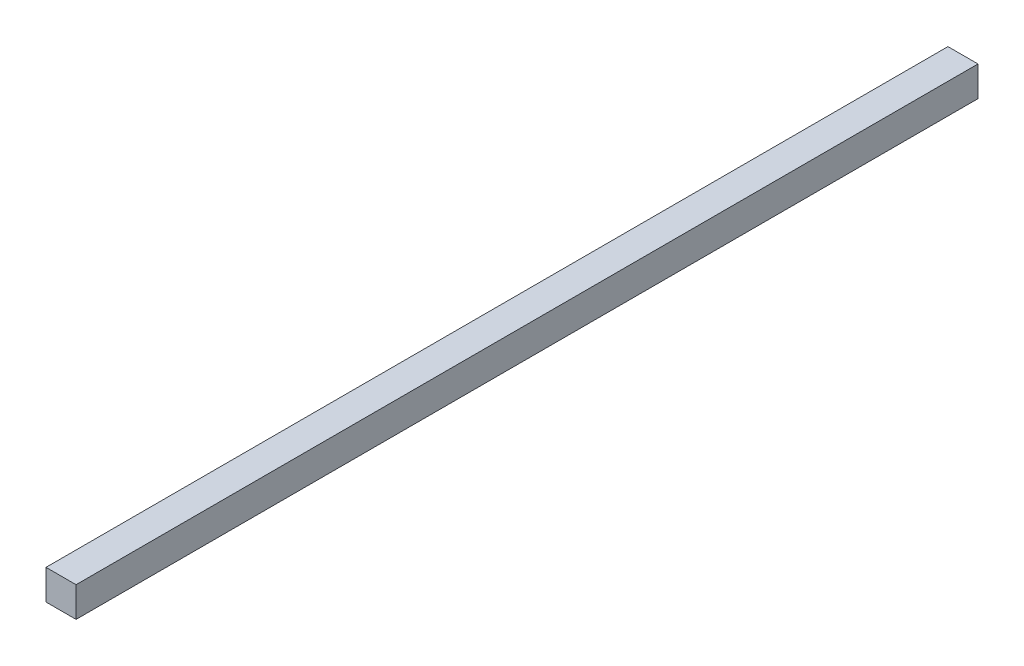
ISO-10303-21;
HEADER;
FILE_DESCRIPTION(('STEP AP214'),'2;1');
FILE_NAME('part.step','',(''),(''),'','','');
FILE_SCHEMA(('AUTOMOTIVE_DESIGN { 1 0 10303 214 1 1 1 1 }'));
ENDSEC;
DATA;
#1=APPLICATION_CONTEXT('core data for automotive mechanical design processes');
#2=APPLICATION_PROTOCOL_DEFINITION('international standard','automotive_design',2000,#1);
#3=PRODUCT_CONTEXT('',#1,'mechanical');
#4=PRODUCT('Part','Part','',(#3));
#5=PRODUCT_RELATED_PRODUCT_CATEGORY('part','',(#4));
#6=PRODUCT_DEFINITION_FORMATION('','',#4);
#7=PRODUCT_DEFINITION_CONTEXT('part definition',#1,'design');
#8=PRODUCT_DEFINITION('design','',#6,#7);
#9=PRODUCT_DEFINITION_SHAPE('','',#8);
#10=(LENGTH_UNIT() NAMED_UNIT(*) SI_UNIT(.MILLI.,.METRE.));
#11=(NAMED_UNIT(*) PLANE_ANGLE_UNIT() SI_UNIT($,.RADIAN.));
#12=(NAMED_UNIT(*) SI_UNIT($,.STERADIAN.) SOLID_ANGLE_UNIT());
#13=UNCERTAINTY_MEASURE_WITH_UNIT(LENGTH_MEASURE(1.E-05),#10,'distance_accuracy_value','');
#14=(GEOMETRIC_REPRESENTATION_CONTEXT(3) GLOBAL_UNCERTAINTY_ASSIGNED_CONTEXT((#13)) GLOBAL_UNIT_ASSIGNED_CONTEXT((#10,
#11,#12)) REPRESENTATION_CONTEXT('',''));
#15=CARTESIAN_POINT('',(0.,0.,0.));
#16=DIRECTION('',(0.,0.,1.));
#17=DIRECTION('',(1.,0.,0.));
#18=AXIS2_PLACEMENT_3D('',#15,#16,#17);
#19=CARTESIAN_POINT('',(-17.9387232059646,5.,300.));
#20=DIRECTION('',(1.,0.,0.));
#21=DIRECTION('',(0.,0.,-1.));
#22=AXIS2_PLACEMENT_3D('',#19,#20,#21);
#23=PLANE('',#22);
#24=DIRECTION('',(0.,-1.,0.));
#25=VECTOR('',#24,1.);
#26=CARTESIAN_POINT('',(-17.9387232059646,5.,0.));
#27=LINE('',#26,#25);
#28=CARTESIAN_POINT('',(-17.9387232059646,5.,0.));
#29=VERTEX_POINT('',#28);
#30=CARTESIAN_POINT('',(-17.9387232059646,-5.,0.));
#31=VERTEX_POINT('',#30);
#32=EDGE_CURVE('E107',#29,#31,#27,.T.);
#33=ORIENTED_EDGE('',*,*,#32,.T.);
#34=DIRECTION('',(0.,0.,-1.));
#35=VECTOR('',#34,1.);
#36=CARTESIAN_POINT('',(-17.9387232059646,-5.,300.));
#37=LINE('',#36,#35);
#38=CARTESIAN_POINT('',(-17.9387232059646,-5.,300.));
#39=VERTEX_POINT('',#38);
#40=EDGE_CURVE('E11',#39,#31,#37,.T.);
#41=ORIENTED_EDGE('',*,*,#40,.F.);
#42=DIRECTION('',(0.,-1.,0.));
#43=VECTOR('',#42,1.);
#44=CARTESIAN_POINT('',(-17.9387232059646,5.,300.));
#45=LINE('',#44,#43);
#46=CARTESIAN_POINT('',(-17.9387232059646,5.,300.));
#47=VERTEX_POINT('',#46);
#48=EDGE_CURVE('E91',#47,#39,#45,.T.);
#49=ORIENTED_EDGE('',*,*,#48,.F.);
#50=DIRECTION('',(0.,0.,-1.));
#51=VECTOR('',#50,1.);
#52=CARTESIAN_POINT('',(-17.9387232059646,5.,300.));
#53=LINE('',#52,#51);
#54=EDGE_CURVE('E103',#47,#29,#53,.T.);
#55=ORIENTED_EDGE('',*,*,#54,.T.);
#56=EDGE_LOOP('',(#33,#41,#49,#55));
#57=FACE_BOUND('',#56,.T.);
#58=ADVANCED_FACE('F39',(#57),#23,.F.);
#59=CARTESIAN_POINT('',(-17.9387232059646,-5.,300.));
#60=DIRECTION('',(0.,1.,0.));
#61=DIRECTION('',(0.,0.,1.));
#62=AXIS2_PLACEMENT_3D('',#59,#60,#61);
#63=PLANE('',#62);
#64=DIRECTION('',(1.,0.,0.));
#65=VECTOR('',#64,1.);
#66=CARTESIAN_POINT('',(-17.9387232059646,-5.,0.));
#67=LINE('',#66,#65);
#68=CARTESIAN_POINT('',(-7.93872320596458,-5.,0.));
#69=VERTEX_POINT('',#68);
#70=EDGE_CURVE('E96',#31,#69,#67,.T.);
#71=ORIENTED_EDGE('',*,*,#70,.T.);
#72=DIRECTION('',(0.,0.,-1.));
#73=VECTOR('',#72,1.);
#74=CARTESIAN_POINT('',(-7.93872320596458,-5.,300.));
#75=LINE('',#74,#73);
#76=CARTESIAN_POINT('',(-7.93872320596458,-5.,300.));
#77=VERTEX_POINT('',#76);
#78=EDGE_CURVE('E48',#77,#69,#75,.T.);
#79=ORIENTED_EDGE('',*,*,#78,.F.);
#80=DIRECTION('',(1.,0.,0.));
#81=VECTOR('',#80,1.);
#82=CARTESIAN_POINT('',(-17.9387232059646,-5.,300.));
#83=LINE('',#82,#81);
#84=EDGE_CURVE('E86',#39,#77,#83,.T.);
#85=ORIENTED_EDGE('',*,*,#84,.F.);
#86=ORIENTED_EDGE('',*,*,#40,.T.);
#87=EDGE_LOOP('',(#71,#79,#85,#86));
#88=FACE_BOUND('',#87,.T.);
#89=ADVANCED_FACE('F95',(#88),#63,.F.);
#90=CARTESIAN_POINT('',(-7.93872320596458,5.,300.));
#91=DIRECTION('',(-1.,0.,0.));
#92=DIRECTION('',(0.,-1.,0.));
#93=AXIS2_PLACEMENT_3D('',#90,#91,#92);
#94=PLANE('',#93);
#95=DIRECTION('',(0.,1.,0.));
#96=VECTOR('',#95,1.);
#97=CARTESIAN_POINT('',(-7.93872320596458,5.,0.));
#98=LINE('',#97,#96);
#99=CARTESIAN_POINT('',(-7.93872320596458,5.,0.));
#100=VERTEX_POINT('',#99);
#101=EDGE_CURVE('E73',#69,#100,#98,.T.);
#102=ORIENTED_EDGE('',*,*,#101,.T.);
#103=DIRECTION('',(0.,0.,-1.));
#104=VECTOR('',#103,1.);
#105=CARTESIAN_POINT('',(-7.93872320596458,5.,300.));
#106=LINE('',#105,#104);
#107=CARTESIAN_POINT('',(-7.93872320596458,5.,300.));
#108=VERTEX_POINT('',#107);
#109=EDGE_CURVE('E98',#108,#100,#106,.T.);
#110=ORIENTED_EDGE('',*,*,#109,.F.);
#111=DIRECTION('',(0.,1.,0.));
#112=VECTOR('',#111,1.);
#113=CARTESIAN_POINT('',(-7.93872320596458,5.,300.));
#114=LINE('',#113,#112);
#115=EDGE_CURVE('E89',#77,#108,#114,.T.);
#116=ORIENTED_EDGE('',*,*,#115,.F.);
#117=ORIENTED_EDGE('',*,*,#78,.T.);
#118=EDGE_LOOP('',(#102,#110,#116,#117));
#119=FACE_BOUND('',#118,.T.);
#120=ADVANCED_FACE('F99',(#119),#94,.F.);
#121=CARTESIAN_POINT('',(-17.9387232059646,5.,300.));
#122=DIRECTION('',(0.,-1.,0.));
#123=DIRECTION('',(0.,0.,-1.));
#124=AXIS2_PLACEMENT_3D('',#121,#122,#123);
#125=PLANE('',#124);
#126=DIRECTION('',(-1.,0.,0.));
#127=VECTOR('',#126,1.);
#128=CARTESIAN_POINT('',(-17.9387232059646,5.,0.));
#129=LINE('',#128,#127);
#130=EDGE_CURVE('E79',#100,#29,#129,.T.);
#131=ORIENTED_EDGE('',*,*,#130,.T.);
#132=ORIENTED_EDGE('',*,*,#54,.F.);
#133=DIRECTION('',(-1.,0.,0.));
#134=VECTOR('',#133,1.);
#135=CARTESIAN_POINT('',(-17.9387232059646,5.,300.));
#136=LINE('',#135,#134);
#137=EDGE_CURVE('E56',#108,#47,#136,.T.);
#138=ORIENTED_EDGE('',*,*,#137,.F.);
#139=ORIENTED_EDGE('',*,*,#109,.T.);
#140=EDGE_LOOP('',(#131,#132,#138,#139));
#141=FACE_BOUND('',#140,.T.);
#142=ADVANCED_FACE('F120',(#141),#125,.F.);
#143=CARTESIAN_POINT('',(0.,0.,300.));
#144=DIRECTION('',(0.,0.,1.));
#145=DIRECTION('',(1.,0.,0.));
#146=AXIS2_PLACEMENT_3D('',#143,#144,#145);
#147=PLANE('',#146);
#148=ORIENTED_EDGE('',*,*,#48,.T.);
#149=ORIENTED_EDGE('',*,*,#84,.T.);
#150=ORIENTED_EDGE('',*,*,#115,.T.);
#151=ORIENTED_EDGE('',*,*,#137,.T.);
#152=EDGE_LOOP('',(#148,#149,#150,#151));
#153=FACE_BOUND('',#152,.T.);
#154=ADVANCED_FACE('F87',(#153),#147,.T.);
#155=CARTESIAN_POINT('',(0.,0.,0.));
#156=DIRECTION('',(0.,0.,1.));
#157=DIRECTION('',(1.,0.,0.));
#158=AXIS2_PLACEMENT_3D('',#155,#156,#157);
#159=PLANE('',#158);
#160=ORIENTED_EDGE('',*,*,#32,.F.);
#161=ORIENTED_EDGE('',*,*,#130,.F.);
#162=ORIENTED_EDGE('',*,*,#101,.F.);
#163=ORIENTED_EDGE('',*,*,#70,.F.);
#164=EDGE_LOOP('',(#160,#161,#162,#163));
#165=FACE_BOUND('',#164,.T.);
#166=ADVANCED_FACE('F123',(#165),#159,.F.);
#167=CLOSED_SHELL('',(#58,#89,#120,#142,#154,#166));
#168=MANIFOLD_SOLID_BREP('B2',#167);
#169=ADVANCED_BREP_SHAPE_REPRESENTATION('',(#18,#168),#14);
#170=SHAPE_DEFINITION_REPRESENTATION(#9,#169);
ENDSEC;
END-ISO-10303-21;
